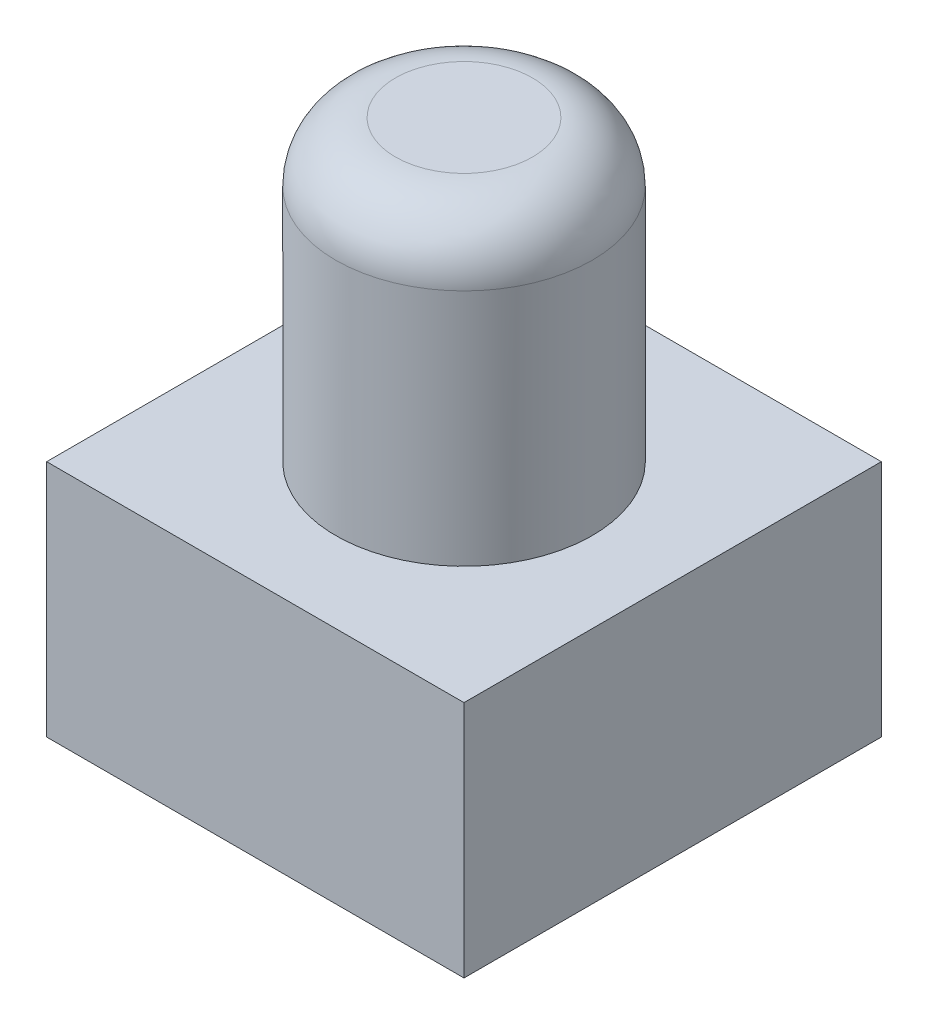
ISO-10303-21;
HEADER;
FILE_DESCRIPTION(('STEP AP214'),'2;1');
FILE_NAME('part.step','',(''),(''),'','','');
FILE_SCHEMA(('AUTOMOTIVE_DESIGN { 1 0 10303 214 1 1 1 1 }'));
ENDSEC;
DATA;
#1=APPLICATION_CONTEXT('core data for automotive mechanical design processes');
#2=APPLICATION_PROTOCOL_DEFINITION('international standard','automotive_design',2000,#1);
#3=PRODUCT_CONTEXT('',#1,'mechanical');
#4=PRODUCT('Part','Part','',(#3));
#5=PRODUCT_RELATED_PRODUCT_CATEGORY('part','',(#4));
#6=PRODUCT_DEFINITION_FORMATION('','',#4);
#7=PRODUCT_DEFINITION_CONTEXT('part definition',#1,'design');
#8=PRODUCT_DEFINITION('design','',#6,#7);
#9=PRODUCT_DEFINITION_SHAPE('','',#8);
#10=(LENGTH_UNIT() NAMED_UNIT(*) SI_UNIT(.MILLI.,.METRE.));
#11=(NAMED_UNIT(*) PLANE_ANGLE_UNIT() SI_UNIT($,.RADIAN.));
#12=(NAMED_UNIT(*) SI_UNIT($,.STERADIAN.) SOLID_ANGLE_UNIT());
#13=UNCERTAINTY_MEASURE_WITH_UNIT(LENGTH_MEASURE(1.E-05),#10,'distance_accuracy_value','');
#14=(GEOMETRIC_REPRESENTATION_CONTEXT(3) GLOBAL_UNCERTAINTY_ASSIGNED_CONTEXT((#13)) GLOBAL_UNIT_ASSIGNED_CONTEXT((#10,
#11,#12)) REPRESENTATION_CONTEXT('',''));
#15=CARTESIAN_POINT('',(0.,0.,0.));
#16=DIRECTION('',(0.,0.,1.));
#17=DIRECTION('',(1.,0.,0.));
#18=AXIS2_PLACEMENT_3D('',#15,#16,#17);
#19=CARTESIAN_POINT('',(0.,7.,0.));
#20=DIRECTION('',(0.,-1.,0.));
#21=DIRECTION('',(0.,0.,-1.));
#22=AXIS2_PLACEMENT_3D('',#19,#20,#21);
#23=CYLINDRICAL_SURFACE('',#22,2.15);
#24=CARTESIAN_POINT('',(0.,6.,0.));
#25=DIRECTION('',(0.,1.,0.));
#26=DIRECTION('',(0.,0.,1.));
#27=AXIS2_PLACEMENT_3D('',#24,#25,#26);
#28=CIRCLE('',#27,2.15);
#29=CARTESIAN_POINT('',(0.,6.,2.15));
#30=VERTEX_POINT('',#29);
#31=EDGE_CURVE('E11',#30,#30,#28,.F.);
#32=ORIENTED_EDGE('',*,*,#31,.T.);
#33=EDGE_LOOP('',(#32));
#34=FACE_BOUND('',#33,.T.);
#35=CARTESIAN_POINT('',(0.,2.,0.));
#36=DIRECTION('',(0.,-1.,0.));
#37=DIRECTION('',(0.,0.,-1.));
#38=AXIS2_PLACEMENT_3D('',#35,#36,#37);
#39=CIRCLE('',#38,2.15);
#40=CARTESIAN_POINT('',(0.,2.,-2.15));
#41=VERTEX_POINT('',#40);
#42=EDGE_CURVE('E172',#41,#41,#39,.T.);
#43=ORIENTED_EDGE('',*,*,#42,.F.);
#44=EDGE_LOOP('',(#43));
#45=FACE_BOUND('',#44,.T.);
#46=ADVANCED_FACE('F41',(#34,#45),#23,.T.);
#47=CARTESIAN_POINT('',(0.,7.,0.));
#48=DIRECTION('',(0.,1.,0.));
#49=DIRECTION('',(0.,0.,1.));
#50=AXIS2_PLACEMENT_3D('',#47,#48,#49);
#51=PLANE('',#50);
#52=CARTESIAN_POINT('',(0.,7.,0.));
#53=DIRECTION('',(0.,1.,0.));
#54=DIRECTION('',(0.,0.,1.));
#55=AXIS2_PLACEMENT_3D('',#52,#53,#54);
#56=CIRCLE('',#55,1.15);
#57=CARTESIAN_POINT('',(0.,7.,1.15));
#58=VERTEX_POINT('',#57);
#59=EDGE_CURVE('E49',#58,#58,#56,.T.);
#60=ORIENTED_EDGE('',*,*,#59,.T.);
#61=EDGE_LOOP('',(#60));
#62=FACE_BOUND('',#61,.T.);
#63=ADVANCED_FACE('F177',(#62),#51,.T.);
#64=CARTESIAN_POINT('',(3.5,-2.,3.5));
#65=DIRECTION('',(-1.,0.,0.));
#66=DIRECTION('',(0.,0.,1.));
#67=AXIS2_PLACEMENT_3D('',#64,#65,#66);
#68=PLANE('',#67);
#69=DIRECTION('',(0.,1.,0.));
#70=VECTOR('',#69,1.);
#71=CARTESIAN_POINT('',(3.5,-2.,-3.5));
#72=LINE('',#71,#70);
#73=CARTESIAN_POINT('',(3.5,-2.,-3.5));
#74=VERTEX_POINT('',#73);
#75=CARTESIAN_POINT('',(3.5,2.,-3.5));
#76=VERTEX_POINT('',#75);
#77=EDGE_CURVE('E164',#74,#76,#72,.T.);
#78=ORIENTED_EDGE('',*,*,#77,.T.);
#79=DIRECTION('',(0.,0.,1.));
#80=VECTOR('',#79,1.);
#81=CARTESIAN_POINT('',(3.5,2.,3.5));
#82=LINE('',#81,#80);
#83=CARTESIAN_POINT('',(3.5,2.,3.5));
#84=VERTEX_POINT('',#83);
#85=EDGE_CURVE('E142',#76,#84,#82,.T.);
#86=ORIENTED_EDGE('',*,*,#85,.T.);
#87=DIRECTION('',(0.,1.,0.));
#88=VECTOR('',#87,1.);
#89=CARTESIAN_POINT('',(3.5,-2.,3.5));
#90=LINE('',#89,#88);
#91=CARTESIAN_POINT('',(3.5,-2.,3.5));
#92=VERTEX_POINT('',#91);
#93=EDGE_CURVE('E170',#92,#84,#90,.T.);
#94=ORIENTED_EDGE('',*,*,#93,.F.);
#95=DIRECTION('',(0.,0.,1.));
#96=VECTOR('',#95,1.);
#97=CARTESIAN_POINT('',(3.5,-2.,3.5));
#98=LINE('',#97,#96);
#99=EDGE_CURVE('E157',#74,#92,#98,.T.);
#100=ORIENTED_EDGE('',*,*,#99,.F.);
#101=EDGE_LOOP('',(#78,#86,#94,#100));
#102=FACE_BOUND('',#101,.T.);
#103=ADVANCED_FACE('F198',(#102),#68,.F.);
#104=CARTESIAN_POINT('',(-3.5,-2.,3.5));
#105=DIRECTION('',(0.,0.,-1.));
#106=DIRECTION('',(-1.,0.,0.));
#107=AXIS2_PLACEMENT_3D('',#104,#105,#106);
#108=PLANE('',#107);
#109=ORIENTED_EDGE('',*,*,#93,.T.);
#110=DIRECTION('',(-1.,0.,0.));
#111=VECTOR('',#110,1.);
#112=CARTESIAN_POINT('',(-3.5,2.,3.5));
#113=LINE('',#112,#111);
#114=CARTESIAN_POINT('',(-3.5,2.,3.5));
#115=VERTEX_POINT('',#114);
#116=EDGE_CURVE('E148',#84,#115,#113,.T.);
#117=ORIENTED_EDGE('',*,*,#116,.T.);
#118=DIRECTION('',(0.,1.,0.));
#119=VECTOR('',#118,1.);
#120=CARTESIAN_POINT('',(-3.5,-2.,3.5));
#121=LINE('',#120,#119);
#122=CARTESIAN_POINT('',(-3.5,-2.,3.5));
#123=VERTEX_POINT('',#122);
#124=EDGE_CURVE('E168',#123,#115,#121,.T.);
#125=ORIENTED_EDGE('',*,*,#124,.F.);
#126=DIRECTION('',(-1.,0.,0.));
#127=VECTOR('',#126,1.);
#128=CARTESIAN_POINT('',(-3.5,-2.,3.5));
#129=LINE('',#128,#127);
#130=EDGE_CURVE('E159',#92,#123,#129,.T.);
#131=ORIENTED_EDGE('',*,*,#130,.F.);
#132=EDGE_LOOP('',(#109,#117,#125,#131));
#133=FACE_BOUND('',#132,.T.);
#134=ADVANCED_FACE('F204',(#133),#108,.F.);
#135=CARTESIAN_POINT('',(-3.5,-2.,3.5));
#136=DIRECTION('',(1.,0.,0.));
#137=DIRECTION('',(0.,0.,-1.));
#138=AXIS2_PLACEMENT_3D('',#135,#136,#137);
#139=PLANE('',#138);
#140=ORIENTED_EDGE('',*,*,#124,.T.);
#141=DIRECTION('',(0.,0.,-1.));
#142=VECTOR('',#141,1.);
#143=CARTESIAN_POINT('',(-3.5,2.,3.5));
#144=LINE('',#143,#142);
#145=CARTESIAN_POINT('',(-3.5,2.,-3.5));
#146=VERTEX_POINT('',#145);
#147=EDGE_CURVE('E151',#115,#146,#144,.T.);
#148=ORIENTED_EDGE('',*,*,#147,.T.);
#149=DIRECTION('',(0.,1.,0.));
#150=VECTOR('',#149,1.);
#151=CARTESIAN_POINT('',(-3.5,-2.,-3.5));
#152=LINE('',#151,#150);
#153=CARTESIAN_POINT('',(-3.5,-2.,-3.5));
#154=VERTEX_POINT('',#153);
#155=EDGE_CURVE('E166',#154,#146,#152,.T.);
#156=ORIENTED_EDGE('',*,*,#155,.F.);
#157=DIRECTION('',(0.,0.,-1.));
#158=VECTOR('',#157,1.);
#159=CARTESIAN_POINT('',(-3.5,-2.,3.5));
#160=LINE('',#159,#158);
#161=EDGE_CURVE('E161',#123,#154,#160,.T.);
#162=ORIENTED_EDGE('',*,*,#161,.F.);
#163=EDGE_LOOP('',(#140,#148,#156,#162));
#164=FACE_BOUND('',#163,.T.);
#165=ADVANCED_FACE('F208',(#164),#139,.F.);
#166=CARTESIAN_POINT('',(-3.5,-2.,-3.5));
#167=DIRECTION('',(0.,0.,1.));
#168=DIRECTION('',(1.,0.,0.));
#169=AXIS2_PLACEMENT_3D('',#166,#167,#168);
#170=PLANE('',#169);
#171=ORIENTED_EDGE('',*,*,#155,.T.);
#172=DIRECTION('',(1.,0.,0.));
#173=VECTOR('',#172,1.);
#174=CARTESIAN_POINT('',(-3.5,2.,-3.5));
#175=LINE('',#174,#173);
#176=EDGE_CURVE('E154',#146,#76,#175,.T.);
#177=ORIENTED_EDGE('',*,*,#176,.T.);
#178=ORIENTED_EDGE('',*,*,#77,.F.);
#179=DIRECTION('',(1.,0.,0.));
#180=VECTOR('',#179,1.);
#181=CARTESIAN_POINT('',(-3.5,-2.,-3.5));
#182=LINE('',#181,#180);
#183=EDGE_CURVE('E64',#154,#74,#182,.T.);
#184=ORIENTED_EDGE('',*,*,#183,.F.);
#185=EDGE_LOOP('',(#171,#177,#178,#184));
#186=FACE_BOUND('',#185,.T.);
#187=ADVANCED_FACE('F212',(#186),#170,.F.);
#188=CARTESIAN_POINT('',(0.,-2.,0.));
#189=DIRECTION('',(0.,-1.,0.));
#190=DIRECTION('',(0.,0.,-1.));
#191=AXIS2_PLACEMENT_3D('',#188,#189,#190);
#192=PLANE('',#191);
#193=DIRECTION('',(0.,0.,-1.));
#194=VECTOR('',#193,1.);
#195=CARTESIAN_POINT('',(-2.75,-2.,2.75));
#196=LINE('',#195,#194);
#197=CARTESIAN_POINT('',(-2.75,-2.,2.75));
#198=VERTEX_POINT('',#197);
#199=CARTESIAN_POINT('',(-2.75,-2.,-2.75));
#200=VERTEX_POINT('',#199);
#201=EDGE_CURVE('E56',#198,#200,#196,.T.);
#202=ORIENTED_EDGE('',*,*,#201,.F.);
#203=DIRECTION('',(-1.,0.,0.));
#204=VECTOR('',#203,1.);
#205=CARTESIAN_POINT('',(-2.75,-2.,2.75));
#206=LINE('',#205,#204);
#207=CARTESIAN_POINT('',(2.75,-2.,2.75));
#208=VERTEX_POINT('',#207);
#209=EDGE_CURVE('E127',#208,#198,#206,.T.);
#210=ORIENTED_EDGE('',*,*,#209,.F.);
#211=DIRECTION('',(0.,0.,1.));
#212=VECTOR('',#211,1.);
#213=CARTESIAN_POINT('',(2.75,-2.,2.75));
#214=LINE('',#213,#212);
#215=CARTESIAN_POINT('',(2.75,-2.,-2.75));
#216=VERTEX_POINT('',#215);
#217=EDGE_CURVE('E130',#216,#208,#214,.T.);
#218=ORIENTED_EDGE('',*,*,#217,.F.);
#219=DIRECTION('',(1.,0.,0.));
#220=VECTOR('',#219,1.);
#221=CARTESIAN_POINT('',(-2.75,-2.,-2.75));
#222=LINE('',#221,#220);
#223=EDGE_CURVE('E136',#200,#216,#222,.T.);
#224=ORIENTED_EDGE('',*,*,#223,.F.);
#225=EDGE_LOOP('',(#202,#210,#218,#224));
#226=FACE_BOUND('',#225,.T.);
#227=ORIENTED_EDGE('',*,*,#99,.T.);
#228=ORIENTED_EDGE('',*,*,#130,.T.);
#229=ORIENTED_EDGE('',*,*,#161,.T.);
#230=ORIENTED_EDGE('',*,*,#183,.T.);
#231=EDGE_LOOP('',(#227,#228,#229,#230));
#232=FACE_BOUND('',#231,.T.);
#233=ADVANCED_FACE('F190',(#226,#232),#192,.T.);
#234=CARTESIAN_POINT('',(0.,2.,0.));
#235=DIRECTION('',(0.,-1.,0.));
#236=DIRECTION('',(0.,0.,-1.));
#237=AXIS2_PLACEMENT_3D('',#234,#235,#236);
#238=PLANE('',#237);
#239=ORIENTED_EDGE('',*,*,#42,.T.);
#240=EDGE_LOOP('',(#239));
#241=FACE_BOUND('',#240,.T.);
#242=ORIENTED_EDGE('',*,*,#85,.F.);
#243=ORIENTED_EDGE('',*,*,#176,.F.);
#244=ORIENTED_EDGE('',*,*,#147,.F.);
#245=ORIENTED_EDGE('',*,*,#116,.F.);
#246=EDGE_LOOP('',(#242,#243,#244,#245));
#247=FACE_BOUND('',#246,.T.);
#248=ADVANCED_FACE('F180',(#241,#247),#238,.F.);
#249=CARTESIAN_POINT('',(0.,6.,0.));
#250=DIRECTION('',(0.,1.,0.));
#251=DIRECTION('',(0.,0.,1.));
#252=AXIS2_PLACEMENT_3D('',#249,#250,#251);
#253=TOROIDAL_SURFACE('',#252,1.15,1.);
#254=ORIENTED_EDGE('',*,*,#31,.F.);
#255=EDGE_LOOP('',(#254));
#256=FACE_BOUND('',#255,.T.);
#257=ORIENTED_EDGE('',*,*,#59,.F.);
#258=EDGE_LOOP('',(#257));
#259=FACE_BOUND('',#258,.T.);
#260=ADVANCED_FACE('F43',(#256,#259),#253,.T.);
#261=CARTESIAN_POINT('',(-2.75,0.,2.75));
#262=DIRECTION('',(-1.,0.,0.));
#263=DIRECTION('',(0.,0.,1.));
#264=AXIS2_PLACEMENT_3D('',#261,#262,#263);
#265=PLANE('',#264);
#266=ORIENTED_EDGE('',*,*,#201,.T.);
#267=DIRECTION('',(0.,-1.,0.));
#268=VECTOR('',#267,1.);
#269=CARTESIAN_POINT('',(-2.75,0.,-2.75));
#270=LINE('',#269,#268);
#271=CARTESIAN_POINT('',(-2.75,0.,-2.75));
#272=VERTEX_POINT('',#271);
#273=EDGE_CURVE('E105',#272,#200,#270,.T.);
#274=ORIENTED_EDGE('',*,*,#273,.F.);
#275=DIRECTION('',(0.,0.,-1.));
#276=VECTOR('',#275,1.);
#277=CARTESIAN_POINT('',(-2.75,0.,2.75));
#278=LINE('',#277,#276);
#279=CARTESIAN_POINT('',(-2.75,0.,2.75));
#280=VERTEX_POINT('',#279);
#281=EDGE_CURVE('E109',#280,#272,#278,.T.);
#282=ORIENTED_EDGE('',*,*,#281,.F.);
#283=DIRECTION('',(0.,-1.,0.));
#284=VECTOR('',#283,1.);
#285=CARTESIAN_POINT('',(-2.75,0.,2.75));
#286=LINE('',#285,#284);
#287=EDGE_CURVE('E140',#280,#198,#286,.T.);
#288=ORIENTED_EDGE('',*,*,#287,.T.);
#289=EDGE_LOOP('',(#266,#274,#282,#288));
#290=FACE_BOUND('',#289,.T.);
#291=ADVANCED_FACE('F107',(#290),#265,.F.);
#292=CARTESIAN_POINT('',(-2.75,0.,2.75));
#293=DIRECTION('',(0.,0.,1.));
#294=DIRECTION('',(1.,0.,0.));
#295=AXIS2_PLACEMENT_3D('',#292,#293,#294);
#296=PLANE('',#295);
#297=ORIENTED_EDGE('',*,*,#209,.T.);
#298=ORIENTED_EDGE('',*,*,#287,.F.);
#299=DIRECTION('',(-1.,0.,0.));
#300=VECTOR('',#299,1.);
#301=CARTESIAN_POINT('',(-2.75,0.,2.75));
#302=LINE('',#301,#300);
#303=CARTESIAN_POINT('',(2.75,0.,2.75));
#304=VERTEX_POINT('',#303);
#305=EDGE_CURVE('E115',#304,#280,#302,.T.);
#306=ORIENTED_EDGE('',*,*,#305,.F.);
#307=DIRECTION('',(0.,-1.,0.));
#308=VECTOR('',#307,1.);
#309=CARTESIAN_POINT('',(2.75,0.,2.75));
#310=LINE('',#309,#308);
#311=EDGE_CURVE('E143',#304,#208,#310,.T.);
#312=ORIENTED_EDGE('',*,*,#311,.T.);
#313=EDGE_LOOP('',(#297,#298,#306,#312));
#314=FACE_BOUND('',#313,.T.);
#315=ADVANCED_FACE('F187',(#314),#296,.F.);
#316=CARTESIAN_POINT('',(2.75,0.,2.75));
#317=DIRECTION('',(1.,0.,0.));
#318=DIRECTION('',(0.,0.,-1.));
#319=AXIS2_PLACEMENT_3D('',#316,#317,#318);
#320=PLANE('',#319);
#321=ORIENTED_EDGE('',*,*,#217,.T.);
#322=ORIENTED_EDGE('',*,*,#311,.F.);
#323=DIRECTION('',(0.,0.,1.));
#324=VECTOR('',#323,1.);
#325=CARTESIAN_POINT('',(2.75,0.,2.75));
#326=LINE('',#325,#324);
#327=CARTESIAN_POINT('',(2.75,0.,-2.75));
#328=VERTEX_POINT('',#327);
#329=EDGE_CURVE('E123',#328,#304,#326,.T.);
#330=ORIENTED_EDGE('',*,*,#329,.F.);
#331=DIRECTION('',(0.,-1.,0.));
#332=VECTOR('',#331,1.);
#333=CARTESIAN_POINT('',(2.75,0.,-2.75));
#334=LINE('',#333,#332);
#335=EDGE_CURVE('E114',#328,#216,#334,.T.);
#336=ORIENTED_EDGE('',*,*,#335,.T.);
#337=EDGE_LOOP('',(#321,#322,#330,#336));
#338=FACE_BOUND('',#337,.T.);
#339=ADVANCED_FACE('F221',(#338),#320,.F.);
#340=CARTESIAN_POINT('',(-2.75,0.,-2.75));
#341=DIRECTION('',(0.,0.,-1.));
#342=DIRECTION('',(-1.,0.,0.));
#343=AXIS2_PLACEMENT_3D('',#340,#341,#342);
#344=PLANE('',#343);
#345=ORIENTED_EDGE('',*,*,#223,.T.);
#346=ORIENTED_EDGE('',*,*,#335,.F.);
#347=DIRECTION('',(1.,0.,0.));
#348=VECTOR('',#347,1.);
#349=CARTESIAN_POINT('',(-2.75,0.,-2.75));
#350=LINE('',#349,#348);
#351=EDGE_CURVE('E118',#272,#328,#350,.T.);
#352=ORIENTED_EDGE('',*,*,#351,.F.);
#353=ORIENTED_EDGE('',*,*,#273,.T.);
#354=EDGE_LOOP('',(#345,#346,#352,#353));
#355=FACE_BOUND('',#354,.T.);
#356=ADVANCED_FACE('F119',(#355),#344,.F.);
#357=CARTESIAN_POINT('',(0.,0.,0.));
#358=DIRECTION('',(0.,-1.,0.));
#359=DIRECTION('',(0.,0.,-1.));
#360=AXIS2_PLACEMENT_3D('',#357,#358,#359);
#361=PLANE('',#360);
#362=ORIENTED_EDGE('',*,*,#281,.T.);
#363=ORIENTED_EDGE('',*,*,#351,.T.);
#364=ORIENTED_EDGE('',*,*,#329,.T.);
#365=ORIENTED_EDGE('',*,*,#305,.T.);
#366=EDGE_LOOP('',(#362,#363,#364,#365));
#367=FACE_BOUND('',#366,.T.);
#368=ADVANCED_FACE('F125',(#367),#361,.T.);
#369=CLOSED_SHELL('',(#46,#63,#103,#134,#165,#187,#233,#248,#260,#291,#315,#339,#356,#368));
#370=MANIFOLD_SOLID_BREP('B2',#369);
#371=ADVANCED_BREP_SHAPE_REPRESENTATION('',(#18,#370),#14);
#372=SHAPE_DEFINITION_REPRESENTATION(#9,#371);
ENDSEC;
END-ISO-10303-21;
